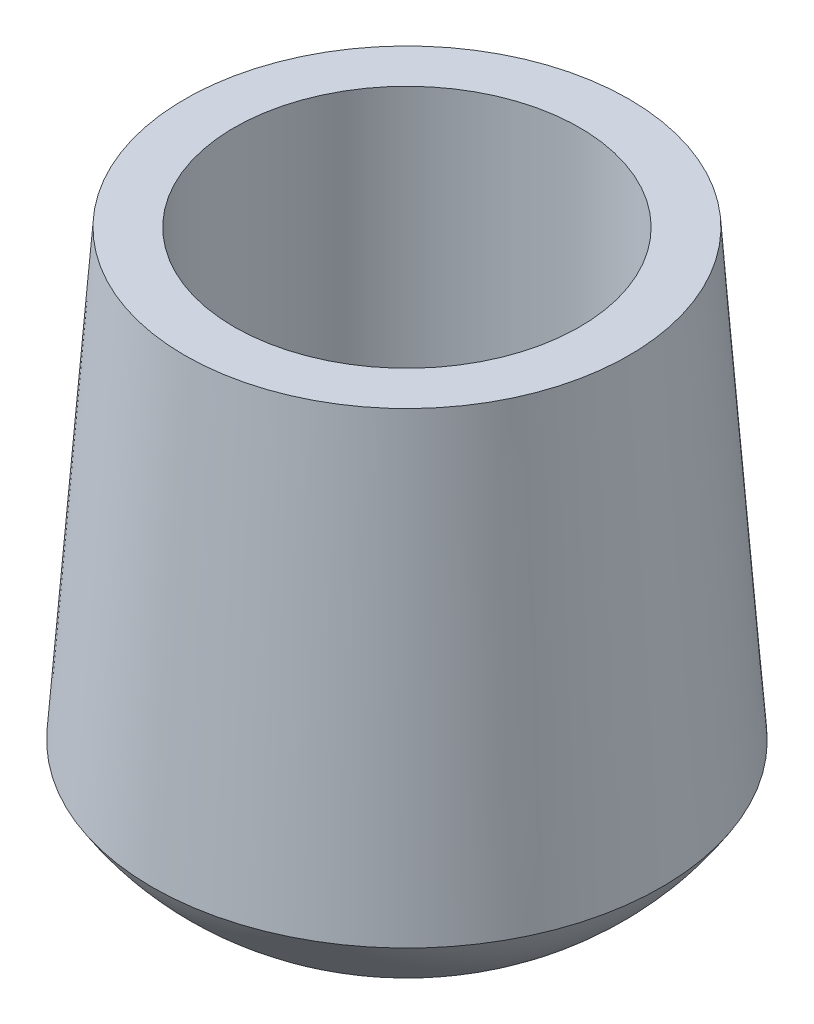
ISO-10303-21;
HEADER;
FILE_DESCRIPTION(('STEP AP214'),'2;1');
FILE_NAME('part.step','',(''),(''),'','','');
FILE_SCHEMA(('AUTOMOTIVE_DESIGN { 1 0 10303 214 1 1 1 1 }'));
ENDSEC;
DATA;
#1=APPLICATION_CONTEXT('core data for automotive mechanical design processes');
#2=APPLICATION_PROTOCOL_DEFINITION('international standard','automotive_design',2000,#1);
#3=PRODUCT_CONTEXT('',#1,'mechanical');
#4=PRODUCT('Part','Part','',(#3));
#5=PRODUCT_RELATED_PRODUCT_CATEGORY('part','',(#4));
#6=PRODUCT_DEFINITION_FORMATION('','',#4);
#7=PRODUCT_DEFINITION_CONTEXT('part definition',#1,'design');
#8=PRODUCT_DEFINITION('design','',#6,#7);
#9=PRODUCT_DEFINITION_SHAPE('','',#8);
#10=(LENGTH_UNIT() NAMED_UNIT(*) SI_UNIT(.MILLI.,.METRE.));
#11=(NAMED_UNIT(*) PLANE_ANGLE_UNIT() SI_UNIT($,.RADIAN.));
#12=(NAMED_UNIT(*) SI_UNIT($,.STERADIAN.) SOLID_ANGLE_UNIT());
#13=UNCERTAINTY_MEASURE_WITH_UNIT(LENGTH_MEASURE(1.E-05),#10,'distance_accuracy_value','');
#14=(GEOMETRIC_REPRESENTATION_CONTEXT(3) GLOBAL_UNCERTAINTY_ASSIGNED_CONTEXT((#13)) GLOBAL_UNIT_ASSIGNED_CONTEXT((#10,
#11,#12)) REPRESENTATION_CONTEXT('',''));
#15=CARTESIAN_POINT('',(0.,0.,0.));
#16=DIRECTION('',(0.,0.,1.));
#17=DIRECTION('',(1.,0.,0.));
#18=AXIS2_PLACEMENT_3D('',#15,#16,#17);
#19=CARTESIAN_POINT('',(0.,0.,0.));
#20=DIRECTION('',(0.,1.,0.));
#21=DIRECTION('',(0.,0.,1.));
#22=AXIS2_PLACEMENT_3D('',#19,#20,#21);
#23=PLANE('',#22);
#24=CARTESIAN_POINT('',(0.,0.,0.));
#25=DIRECTION('',(0.,1.,0.));
#26=DIRECTION('',(0.,0.,1.));
#27=AXIS2_PLACEMENT_3D('',#24,#25,#26);
#28=CIRCLE('',#27,7.);
#29=CARTESIAN_POINT('',(0.,0.,7.));
#30=VERTEX_POINT('',#29);
#31=EDGE_CURVE('E11',#30,#30,#28,.T.);
#32=ORIENTED_EDGE('',*,*,#31,.T.);
#33=EDGE_LOOP('',(#32));
#34=FACE_BOUND('',#33,.T.);
#35=ADVANCED_FACE('F36',(#34),#23,.T.);
#36=CARTESIAN_POINT('',(0.,0.,0.));
#37=DIRECTION('',(0.,1.,0.));
#38=DIRECTION('',(0.,0.,1.));
#39=AXIS2_PLACEMENT_3D('',#36,#37,#38);
#40=CYLINDRICAL_SURFACE('',#39,7.);
#41=CARTESIAN_POINT('',(0.,18.5986315297365,0.));
#42=DIRECTION('',(0.,1.,0.));
#43=DIRECTION('',(0.,0.,1.));
#44=AXIS2_PLACEMENT_3D('',#41,#42,#43);
#45=CIRCLE('',#44,7.);
#46=CARTESIAN_POINT('',(0.,18.5986315297365,7.));
#47=VERTEX_POINT('',#46);
#48=EDGE_CURVE('E42',#47,#47,#45,.T.);
#49=ORIENTED_EDGE('',*,*,#48,.T.);
#50=EDGE_LOOP('',(#49));
#51=FACE_BOUND('',#50,.T.);
#52=ORIENTED_EDGE('',*,*,#31,.F.);
#53=EDGE_LOOP('',(#52));
#54=FACE_BOUND('',#53,.T.);
#55=ADVANCED_FACE('F61',(#51,#54),#40,.F.);
#56=CARTESIAN_POINT('',(-7.,18.5986315297365,0.));
#57=DIRECTION('',(0.,1.,0.));
#58=DIRECTION('',(0.,0.,1.));
#59=AXIS2_PLACEMENT_3D('',#56,#57,#58);
#60=PLANE('',#59);
#61=CARTESIAN_POINT('',(0.,18.5986315297365,0.));
#62=DIRECTION('',(0.,1.,0.));
#63=DIRECTION('',(0.,0.,1.));
#64=AXIS2_PLACEMENT_3D('',#61,#62,#63);
#65=CIRCLE('',#64,9.);
#66=CARTESIAN_POINT('',(0.,18.5986315297365,9.));
#67=VERTEX_POINT('',#66);
#68=EDGE_CURVE('E54',#67,#67,#65,.T.);
#69=ORIENTED_EDGE('',*,*,#68,.T.);
#70=EDGE_LOOP('',(#69));
#71=FACE_BOUND('',#70,.T.);
#72=ORIENTED_EDGE('',*,*,#48,.F.);
#73=EDGE_LOOP('',(#72));
#74=FACE_BOUND('',#73,.T.);
#75=ADVANCED_FACE('F64',(#71,#74),#60,.T.);
#76=CARTESIAN_POINT('',(0.,18.5986315297365,0.));
#77=DIRECTION('',(0.,-1.,0.));
#78=DIRECTION('',(0.,0.,-1.));
#79=AXIS2_PLACEMENT_3D('',#76,#77,#78);
#80=CONICAL_SURFACE('',#79,9.,0.0735836562540632);
#81=CARTESIAN_POINT('',(0.,0.598631529736523,0.));
#82=DIRECTION('',(0.,1.,0.));
#83=DIRECTION('',(0.,0.,1.));
#84=AXIS2_PLACEMENT_3D('',#81,#82,#83);
#85=CIRCLE('',#84,10.326901537709);
#86=CARTESIAN_POINT('',(0.,0.598631529736523,10.326901537709));
#87=VERTEX_POINT('',#86);
#88=EDGE_CURVE('E52',#87,#87,#85,.T.);
#89=ORIENTED_EDGE('',*,*,#88,.T.);
#90=EDGE_LOOP('',(#89));
#91=FACE_BOUND('',#90,.T.);
#92=ORIENTED_EDGE('',*,*,#68,.F.);
#93=EDGE_LOOP('',(#92));
#94=FACE_BOUND('',#93,.T.);
#95=ADVANCED_FACE('F48',(#91,#94),#80,.T.);
#96=CARTESIAN_POINT('',(0.,6.17002453117509,1.25550559673987));
#97=DIRECTION('',(-1.,0.,0.));
#98=DIRECTION('',(0.,0.,1.));
#99=AXIS2_PLACEMENT_3D('',#96,#97,#98);
#100=CIRCLE('',#99,10.6456866520817);
#101=TRIMMED_CURVE('',#100,(PARAMETER_VALUE(-1.6890070573658)),
(PARAMETER_VALUE(1.6890070573658)),.T.,.PARAMETER.);
#102=CARTESIAN_POINT('',(0.,6.17002453117509,0.));
#103=DIRECTION('',(0.,1.,0.));
#104=AXIS1_PLACEMENT('',#102,#103);
#105=SURFACE_OF_REVOLUTION('',#101,#104);
#106=CARTESIAN_POINT('',(0.,-4.40136847026348,0.));
#107=VERTEX_POINT('',#106);
#108=VERTEX_LOOP('',#107);
#109=FACE_BOUND('',#108,.T.);
#110=ORIENTED_EDGE('',*,*,#88,.F.);
#111=EDGE_LOOP('',(#110));
#112=FACE_BOUND('',#111,.T.);
#113=ADVANCED_FACE('F45',(#109,#112),#105,.T.);
#114=CLOSED_SHELL('',(#35,#55,#75,#95,#113));
#115=MANIFOLD_SOLID_BREP('B2',#114);
#116=ADVANCED_BREP_SHAPE_REPRESENTATION('',(#18,#115),#14);
#117=SHAPE_DEFINITION_REPRESENTATION(#9,#116);
ENDSEC;
END-ISO-10303-21;
